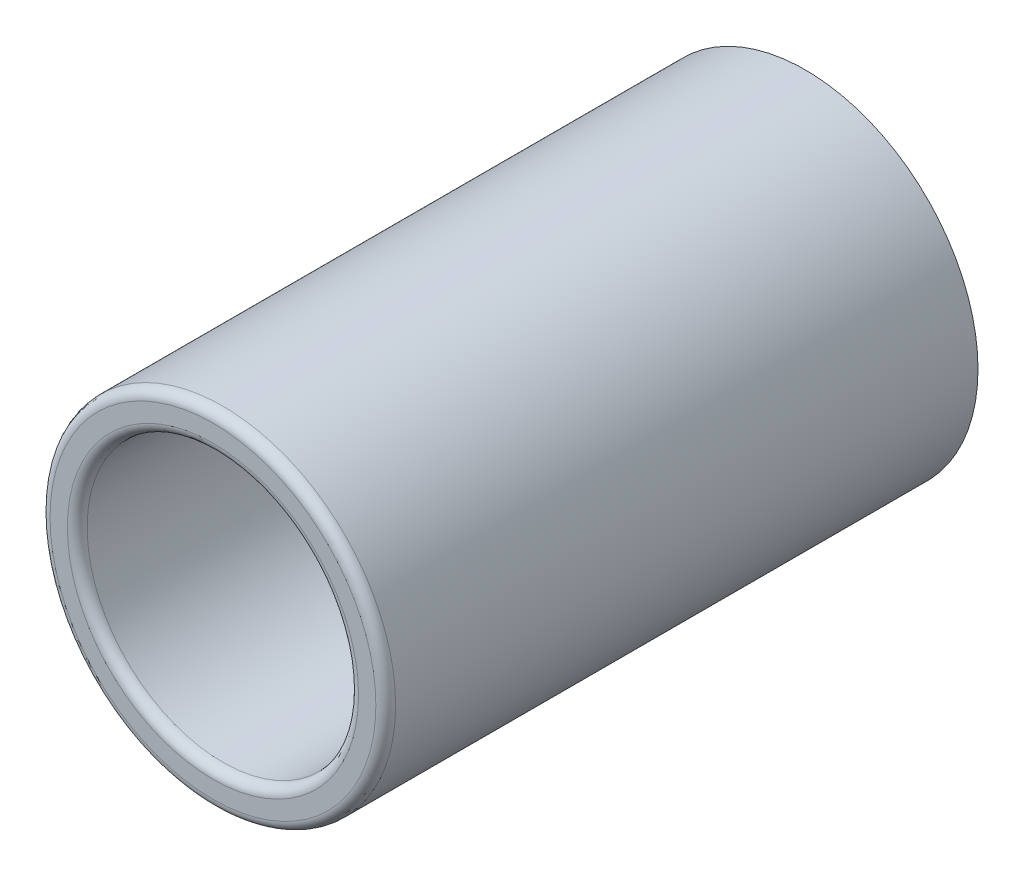
ISO-10303-21;
HEADER;
FILE_DESCRIPTION(('STEP AP214'),'2;1');
FILE_NAME('part.step','',(''),(''),'','','');
FILE_SCHEMA(('AUTOMOTIVE_DESIGN { 1 0 10303 214 1 1 1 1 }'));
ENDSEC;
DATA;
#1=APPLICATION_CONTEXT('core data for automotive mechanical design processes');
#2=APPLICATION_PROTOCOL_DEFINITION('international standard','automotive_design',2000,#1);
#3=PRODUCT_CONTEXT('',#1,'mechanical');
#4=PRODUCT('Part','Part','',(#3));
#5=PRODUCT_RELATED_PRODUCT_CATEGORY('part','',(#4));
#6=PRODUCT_DEFINITION_FORMATION('','',#4);
#7=PRODUCT_DEFINITION_CONTEXT('part definition',#1,'design');
#8=PRODUCT_DEFINITION('design','',#6,#7);
#9=PRODUCT_DEFINITION_SHAPE('','',#8);
#10=(LENGTH_UNIT() NAMED_UNIT(*) SI_UNIT(.MILLI.,.METRE.));
#11=(NAMED_UNIT(*) PLANE_ANGLE_UNIT() SI_UNIT($,.RADIAN.));
#12=(NAMED_UNIT(*) SI_UNIT($,.STERADIAN.) SOLID_ANGLE_UNIT());
#13=UNCERTAINTY_MEASURE_WITH_UNIT(LENGTH_MEASURE(1.E-05),#10,'distance_accuracy_value','');
#14=(GEOMETRIC_REPRESENTATION_CONTEXT(3) GLOBAL_UNCERTAINTY_ASSIGNED_CONTEXT((#13)) GLOBAL_UNIT_ASSIGNED_CONTEXT((#10,
#11,#12)) REPRESENTATION_CONTEXT('',''));
#15=CARTESIAN_POINT('',(0.,0.,0.));
#16=DIRECTION('',(0.,0.,1.));
#17=DIRECTION('',(1.,0.,0.));
#18=AXIS2_PLACEMENT_3D('',#15,#16,#17);
#19=CARTESIAN_POINT('',(0.,0.,12.));
#20=DIRECTION('',(0.,0.,1.));
#21=DIRECTION('',(1.,0.,0.));
#22=AXIS2_PLACEMENT_3D('',#19,#20,#21);
#23=PLANE('',#22);
#24=CARTESIAN_POINT('',(0.,0.,12.));
#25=DIRECTION('',(0.,0.,1.));
#26=DIRECTION('',(1.,0.,0.));
#27=AXIS2_PLACEMENT_3D('',#24,#25,#26);
#28=CIRCLE('',#27,3.3);
#29=CARTESIAN_POINT('',(3.3,0.,12.));
#30=VERTEX_POINT('',#29);
#31=EDGE_CURVE('E41',#30,#30,#28,.T.);
#32=ORIENTED_EDGE('',*,*,#31,.T.);
#33=EDGE_LOOP('',(#32));
#34=FACE_BOUND('',#33,.T.);
#35=CARTESIAN_POINT('',(0.,0.,12.));
#36=DIRECTION('',(0.,0.,1.));
#37=DIRECTION('',(1.,0.,0.));
#38=AXIS2_PLACEMENT_3D('',#35,#36,#37);
#39=CIRCLE('',#38,2.95);
#40=CARTESIAN_POINT('',(2.95,0.,12.));
#41=VERTEX_POINT('',#40);
#42=EDGE_CURVE('E45',#41,#41,#39,.F.);
#43=ORIENTED_EDGE('',*,*,#42,.T.);
#44=EDGE_LOOP('',(#43));
#45=FACE_BOUND('',#44,.T.);
#46=ADVANCED_FACE('F30',(#34,#45),#23,.T.);
#47=CARTESIAN_POINT('',(0.,0.,0.));
#48=DIRECTION('',(0.,0.,1.));
#49=DIRECTION('',(1.,0.,0.));
#50=AXIS2_PLACEMENT_3D('',#47,#48,#49);
#51=PLANE('',#50);
#52=CARTESIAN_POINT('',(0.,0.,0.));
#53=DIRECTION('',(0.,0.,1.));
#54=DIRECTION('',(1.,0.,0.));
#55=AXIS2_PLACEMENT_3D('',#52,#53,#54);
#56=CIRCLE('',#55,3.5);
#57=CARTESIAN_POINT('',(3.5,0.,0.));
#58=VERTEX_POINT('',#57);
#59=EDGE_CURVE('E50',#58,#58,#56,.T.);
#60=ORIENTED_EDGE('',*,*,#59,.F.);
#61=EDGE_LOOP('',(#60));
#62=FACE_BOUND('',#61,.T.);
#63=CARTESIAN_POINT('',(0.,0.,0.));
#64=DIRECTION('',(0.,0.,1.));
#65=DIRECTION('',(1.,0.,0.));
#66=AXIS2_PLACEMENT_3D('',#63,#64,#65);
#67=CIRCLE('',#66,2.75);
#68=CARTESIAN_POINT('',(2.75,0.,0.));
#69=VERTEX_POINT('',#68);
#70=EDGE_CURVE('E53',#69,#69,#67,.T.);
#71=ORIENTED_EDGE('',*,*,#70,.T.);
#72=EDGE_LOOP('',(#71));
#73=FACE_BOUND('',#72,.T.);
#74=ADVANCED_FACE('F57',(#62,#73),#51,.F.);
#75=CARTESIAN_POINT('',(0.,0.,12.));
#76=DIRECTION('',(0.,0.,-1.));
#77=DIRECTION('',(-1.,0.,0.));
#78=AXIS2_PLACEMENT_3D('',#75,#76,#77);
#79=CYLINDRICAL_SURFACE('',#78,3.5);
#80=CARTESIAN_POINT('',(0.,0.,11.8));
#81=DIRECTION('',(0.,0.,1.));
#82=DIRECTION('',(1.,0.,0.));
#83=AXIS2_PLACEMENT_3D('',#80,#81,#82);
#84=CIRCLE('',#83,3.5);
#85=CARTESIAN_POINT('',(3.5,0.,11.8));
#86=VERTEX_POINT('',#85);
#87=EDGE_CURVE('E37',#86,#86,#84,.F.);
#88=ORIENTED_EDGE('',*,*,#87,.T.);
#89=EDGE_LOOP('',(#88));
#90=FACE_BOUND('',#89,.T.);
#91=ORIENTED_EDGE('',*,*,#59,.T.);
#92=EDGE_LOOP('',(#91));
#93=FACE_BOUND('',#92,.T.);
#94=ADVANCED_FACE('F62',(#90,#93),#79,.T.);
#95=CARTESIAN_POINT('',(0.,0.,12.));
#96=DIRECTION('',(0.,0.,-1.));
#97=DIRECTION('',(-1.,0.,0.));
#98=AXIS2_PLACEMENT_3D('',#95,#96,#97);
#99=CYLINDRICAL_SURFACE('',#98,2.75);
#100=CARTESIAN_POINT('',(0.,0.,11.8));
#101=DIRECTION('',(0.,0.,1.));
#102=DIRECTION('',(1.,0.,0.));
#103=AXIS2_PLACEMENT_3D('',#100,#101,#102);
#104=CIRCLE('',#103,2.75);
#105=CARTESIAN_POINT('',(2.75,0.,11.8));
#106=VERTEX_POINT('',#105);
#107=EDGE_CURVE('E10',#106,#106,#104,.T.);
#108=ORIENTED_EDGE('',*,*,#107,.T.);
#109=EDGE_LOOP('',(#108));
#110=FACE_BOUND('',#109,.T.);
#111=ORIENTED_EDGE('',*,*,#70,.F.);
#112=EDGE_LOOP('',(#111));
#113=FACE_BOUND('',#112,.T.);
#114=ADVANCED_FACE('F59',(#110,#113),#99,.F.);
#115=CARTESIAN_POINT('',(0.,0.,11.8));
#116=DIRECTION('',(0.,0.,1.));
#117=DIRECTION('',(1.,0.,0.));
#118=AXIS2_PLACEMENT_3D('',#115,#116,#117);
#119=TOROIDAL_SURFACE('',#118,3.3,0.2);
#120=ORIENTED_EDGE('',*,*,#87,.F.);
#121=EDGE_LOOP('',(#120));
#122=FACE_BOUND('',#121,.T.);
#123=ORIENTED_EDGE('',*,*,#31,.F.);
#124=EDGE_LOOP('',(#123));
#125=FACE_BOUND('',#124,.T.);
#126=ADVANCED_FACE('F61',(#122,#125),#119,.T.);
#127=CARTESIAN_POINT('',(0.,0.,11.8));
#128=DIRECTION('',(0.,0.,1.));
#129=DIRECTION('',(1.,0.,0.));
#130=AXIS2_PLACEMENT_3D('',#127,#128,#129);
#131=TOROIDAL_SURFACE('',#130,2.95,0.2);
#132=ORIENTED_EDGE('',*,*,#42,.F.);
#133=EDGE_LOOP('',(#132));
#134=FACE_BOUND('',#133,.T.);
#135=ORIENTED_EDGE('',*,*,#107,.F.);
#136=EDGE_LOOP('',(#135));
#137=FACE_BOUND('',#136,.T.);
#138=ADVANCED_FACE('F32',(#134,#137),#131,.T.);
#139=CLOSED_SHELL('',(#46,#74,#94,#114,#126,#138));
#140=MANIFOLD_SOLID_BREP('B2',#139);
#141=ADVANCED_BREP_SHAPE_REPRESENTATION('',(#18,#140),#14);
#142=SHAPE_DEFINITION_REPRESENTATION(#9,#141);
ENDSEC;
END-ISO-10303-21;
